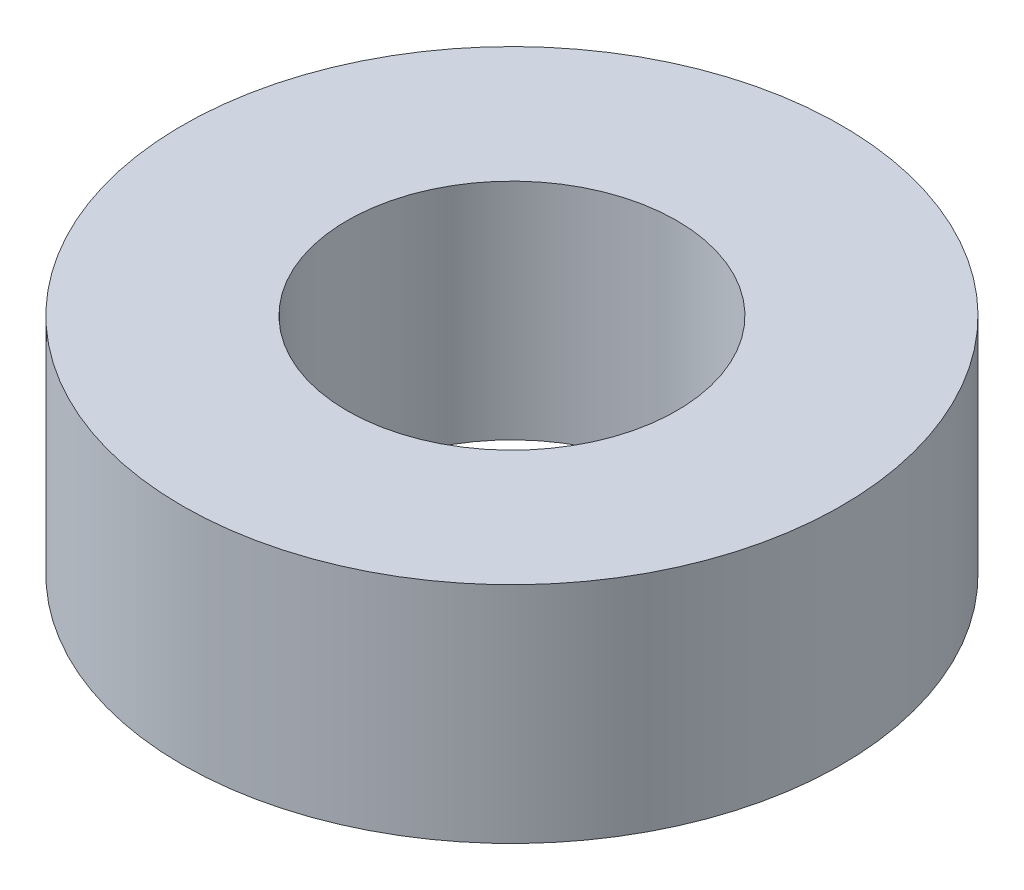
ISO-10303-21;
HEADER;
FILE_DESCRIPTION(('STEP AP214'),'2;1');
FILE_NAME('part.step','',(''),(''),'','','');
FILE_SCHEMA(('AUTOMOTIVE_DESIGN { 1 0 10303 214 1 1 1 1 }'));
ENDSEC;
DATA;
#1=APPLICATION_CONTEXT('core data for automotive mechanical design processes');
#2=APPLICATION_PROTOCOL_DEFINITION('international standard','automotive_design',2000,#1);
#3=PRODUCT_CONTEXT('',#1,'mechanical');
#4=PRODUCT('Part','Part','',(#3));
#5=PRODUCT_RELATED_PRODUCT_CATEGORY('part','',(#4));
#6=PRODUCT_DEFINITION_FORMATION('','',#4);
#7=PRODUCT_DEFINITION_CONTEXT('part definition',#1,'design');
#8=PRODUCT_DEFINITION('design','',#6,#7);
#9=PRODUCT_DEFINITION_SHAPE('','',#8);
#10=(LENGTH_UNIT() NAMED_UNIT(*) SI_UNIT(.MILLI.,.METRE.));
#11=(NAMED_UNIT(*) PLANE_ANGLE_UNIT() SI_UNIT($,.RADIAN.));
#12=(NAMED_UNIT(*) SI_UNIT($,.STERADIAN.) SOLID_ANGLE_UNIT());
#13=UNCERTAINTY_MEASURE_WITH_UNIT(LENGTH_MEASURE(1.E-05),#10,'distance_accuracy_value','');
#14=(GEOMETRIC_REPRESENTATION_CONTEXT(3) GLOBAL_UNCERTAINTY_ASSIGNED_CONTEXT((#13)) GLOBAL_UNIT_ASSIGNED_CONTEXT((#10,
#11,#12)) REPRESENTATION_CONTEXT('',''));
#15=CARTESIAN_POINT('',(0.,0.,0.));
#16=DIRECTION('',(0.,0.,1.));
#17=DIRECTION('',(1.,0.,0.));
#18=AXIS2_PLACEMENT_3D('',#15,#16,#17);
#19=CARTESIAN_POINT('',(0.,17.,0.));
#20=DIRECTION('',(0.,-1.,0.));
#21=DIRECTION('',(0.,0.,-1.));
#22=AXIS2_PLACEMENT_3D('',#19,#20,#21);
#23=CYLINDRICAL_SURFACE('',#22,25.);
#24=CARTESIAN_POINT('',(0.,17.,0.));
#25=DIRECTION('',(0.,1.,0.));
#26=DIRECTION('',(0.,0.,1.));
#27=AXIS2_PLACEMENT_3D('',#24,#25,#26);
#28=CIRCLE('',#27,25.);
#29=CARTESIAN_POINT('',(0.,17.,25.));
#30=VERTEX_POINT('',#29);
#31=EDGE_CURVE('E10',#30,#30,#28,.T.);
#32=ORIENTED_EDGE('',*,*,#31,.F.);
#33=EDGE_LOOP('',(#32));
#34=FACE_BOUND('',#33,.T.);
#35=CARTESIAN_POINT('',(0.,0.,0.));
#36=DIRECTION('',(0.,1.,0.));
#37=DIRECTION('',(0.,0.,1.));
#38=AXIS2_PLACEMENT_3D('',#35,#36,#37);
#39=CIRCLE('',#38,25.);
#40=CARTESIAN_POINT('',(0.,0.,25.));
#41=VERTEX_POINT('',#40);
#42=EDGE_CURVE('E37',#41,#41,#39,.T.);
#43=ORIENTED_EDGE('',*,*,#42,.T.);
#44=EDGE_LOOP('',(#43));
#45=FACE_BOUND('',#44,.T.);
#46=ADVANCED_FACE('F40',(#34,#45),#23,.T.);
#47=CARTESIAN_POINT('',(0.,17.,0.));
#48=DIRECTION('',(0.,1.,0.));
#49=DIRECTION('',(0.,0.,1.));
#50=AXIS2_PLACEMENT_3D('',#47,#48,#49);
#51=PLANE('',#50);
#52=CARTESIAN_POINT('',(0.,17.,0.));
#53=DIRECTION('',(0.,1.,0.));
#54=DIRECTION('',(0.,0.,1.));
#55=AXIS2_PLACEMENT_3D('',#52,#53,#54);
#56=CIRCLE('',#55,12.5);
#57=CARTESIAN_POINT('',(0.,17.,12.5));
#58=VERTEX_POINT('',#57);
#59=EDGE_CURVE('E50',#58,#58,#56,.T.);
#60=ORIENTED_EDGE('',*,*,#59,.F.);
#61=EDGE_LOOP('',(#60));
#62=FACE_BOUND('',#61,.T.);
#63=ORIENTED_EDGE('',*,*,#31,.T.);
#64=EDGE_LOOP('',(#63));
#65=FACE_BOUND('',#64,.T.);
#66=ADVANCED_FACE('F59',(#62,#65),#51,.T.);
#67=CARTESIAN_POINT('',(0.,0.,0.));
#68=DIRECTION('',(0.,1.,0.));
#69=DIRECTION('',(0.,0.,1.));
#70=AXIS2_PLACEMENT_3D('',#67,#68,#69);
#71=PLANE('',#70);
#72=CARTESIAN_POINT('',(0.,0.,0.));
#73=DIRECTION('',(0.,1.,0.));
#74=DIRECTION('',(0.,0.,1.));
#75=AXIS2_PLACEMENT_3D('',#72,#73,#74);
#76=CIRCLE('',#75,12.5);
#77=CARTESIAN_POINT('',(0.,0.,12.5));
#78=VERTEX_POINT('',#77);
#79=EDGE_CURVE('E47',#78,#78,#76,.T.);
#80=ORIENTED_EDGE('',*,*,#79,.T.);
#81=EDGE_LOOP('',(#80));
#82=FACE_BOUND('',#81,.T.);
#83=ORIENTED_EDGE('',*,*,#42,.F.);
#84=EDGE_LOOP('',(#83));
#85=FACE_BOUND('',#84,.T.);
#86=ADVANCED_FACE('F58',(#82,#85),#71,.F.);
#87=CARTESIAN_POINT('',(0.,17.,0.));
#88=DIRECTION('',(0.,-1.,0.));
#89=DIRECTION('',(0.,0.,-1.));
#90=AXIS2_PLACEMENT_3D('',#87,#88,#89);
#91=CYLINDRICAL_SURFACE('',#90,12.5);
#92=ORIENTED_EDGE('',*,*,#59,.T.);
#93=EDGE_LOOP('',(#92));
#94=FACE_BOUND('',#93,.T.);
#95=ORIENTED_EDGE('',*,*,#79,.F.);
#96=EDGE_LOOP('',(#95));
#97=FACE_BOUND('',#96,.T.);
#98=ADVANCED_FACE('F54',(#94,#97),#91,.F.);
#99=CLOSED_SHELL('',(#46,#66,#86,#98));
#100=MANIFOLD_SOLID_BREP('B2',#99);
#101=ADVANCED_BREP_SHAPE_REPRESENTATION('',(#18,#100),#14);
#102=SHAPE_DEFINITION_REPRESENTATION(#9,#101);
ENDSEC;
END-ISO-10303-21;
